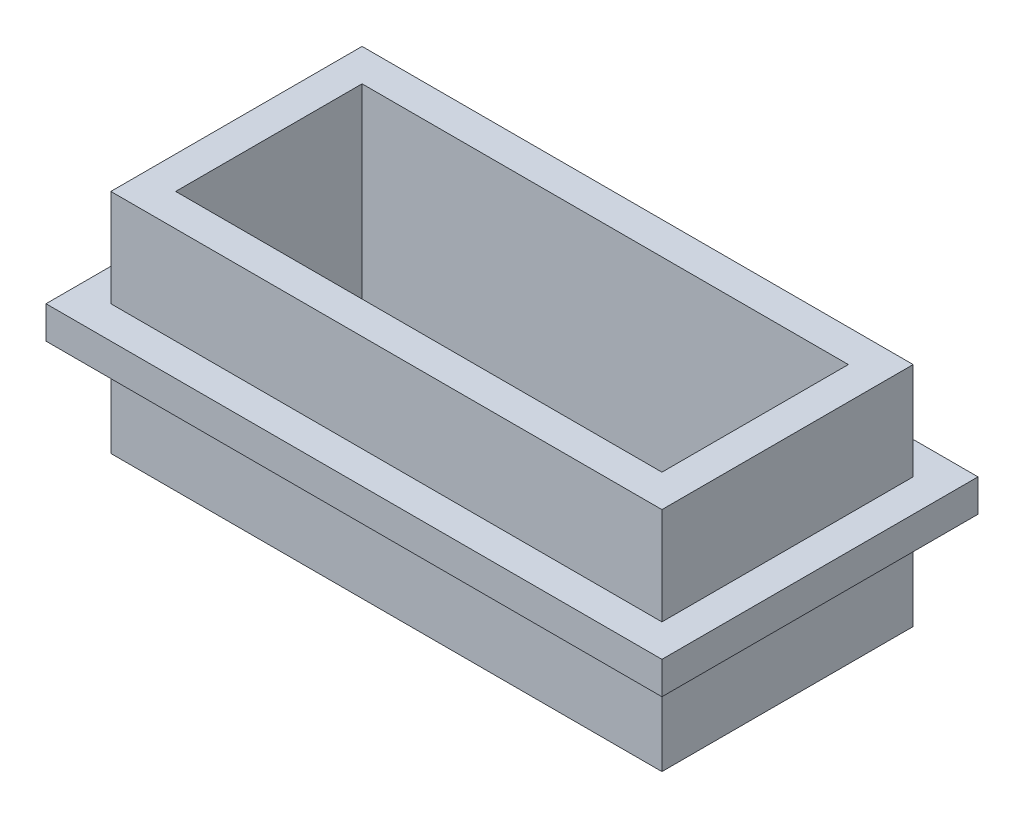
ISO-10303-21;
HEADER;
FILE_DESCRIPTION(('STEP AP214'),'2;1');
FILE_NAME('part.step','',(''),(''),'','','');
FILE_SCHEMA(('AUTOMOTIVE_DESIGN { 1 0 10303 214 1 1 1 1 }'));
ENDSEC;
DATA;
#1=APPLICATION_CONTEXT('core data for automotive mechanical design processes');
#2=APPLICATION_PROTOCOL_DEFINITION('international standard','automotive_design',2000,#1);
#3=PRODUCT_CONTEXT('',#1,'mechanical');
#4=PRODUCT('Part','Part','',(#3));
#5=PRODUCT_RELATED_PRODUCT_CATEGORY('part','',(#4));
#6=PRODUCT_DEFINITION_FORMATION('','',#4);
#7=PRODUCT_DEFINITION_CONTEXT('part definition',#1,'design');
#8=PRODUCT_DEFINITION('design','',#6,#7);
#9=PRODUCT_DEFINITION_SHAPE('','',#8);
#10=(LENGTH_UNIT() NAMED_UNIT(*) SI_UNIT(.MILLI.,.METRE.));
#11=(NAMED_UNIT(*) PLANE_ANGLE_UNIT() SI_UNIT($,.RADIAN.));
#12=(NAMED_UNIT(*) SI_UNIT($,.STERADIAN.) SOLID_ANGLE_UNIT());
#13=UNCERTAINTY_MEASURE_WITH_UNIT(LENGTH_MEASURE(1.E-05),#10,'distance_accuracy_value','');
#14=(GEOMETRIC_REPRESENTATION_CONTEXT(3) GLOBAL_UNCERTAINTY_ASSIGNED_CONTEXT((#13)) GLOBAL_UNIT_ASSIGNED_CONTEXT((#10,
#11,#12)) REPRESENTATION_CONTEXT('',''));
#15=CARTESIAN_POINT('',(0.,0.,0.));
#16=DIRECTION('',(0.,0.,1.));
#17=DIRECTION('',(1.,0.,0.));
#18=AXIS2_PLACEMENT_3D('',#15,#16,#17);
#19=CARTESIAN_POINT('',(21.59,17.78,-9.8425));
#20=DIRECTION('',(-1.,0.,0.));
#21=DIRECTION('',(0.,0.,1.));
#22=AXIS2_PLACEMENT_3D('',#19,#20,#21);
#23=PLANE('',#22);
#24=DIRECTION('',(0.,0.,1.));
#25=VECTOR('',#24,1.);
#26=CARTESIAN_POINT('',(21.59,10.16,-9.8425));
#27=LINE('',#26,#25);
#28=CARTESIAN_POINT('',(21.59,10.16,-9.8425));
#29=VERTEX_POINT('',#28);
#30=CARTESIAN_POINT('',(21.59,10.16,9.8425));
#31=VERTEX_POINT('',#30);
#32=EDGE_CURVE('E53',#29,#31,#27,.T.);
#33=ORIENTED_EDGE('',*,*,#32,.F.);
#34=DIRECTION('',(0.,-1.,0.));
#35=VECTOR('',#34,1.);
#36=CARTESIAN_POINT('',(21.59,17.78,-9.8425));
#37=LINE('',#36,#35);
#38=CARTESIAN_POINT('',(21.59,17.78,-9.8425));
#39=VERTEX_POINT('',#38);
#40=EDGE_CURVE('E11',#39,#29,#37,.T.);
#41=ORIENTED_EDGE('',*,*,#40,.F.);
#42=DIRECTION('',(0.,0.,-1.));
#43=VECTOR('',#42,1.);
#44=CARTESIAN_POINT('',(21.59,17.78,-9.8425));
#45=LINE('',#44,#43);
#46=CARTESIAN_POINT('',(21.59,17.78,9.8425));
#47=VERTEX_POINT('',#46);
#48=EDGE_CURVE('E234',#47,#39,#45,.T.);
#49=ORIENTED_EDGE('',*,*,#48,.F.);
#50=DIRECTION('',(0.,-1.,0.));
#51=VECTOR('',#50,1.);
#52=CARTESIAN_POINT('',(21.59,17.78,9.8425));
#53=LINE('',#52,#51);
#54=EDGE_CURVE('E255',#47,#31,#53,.T.);
#55=ORIENTED_EDGE('',*,*,#54,.T.);
#56=EDGE_LOOP('',(#33,#41,#49,#55));
#57=FACE_BOUND('',#56,.T.);
#58=ADVANCED_FACE('F38',(#57),#23,.F.);
#59=CARTESIAN_POINT('',(-21.59,17.78,-9.8425));
#60=DIRECTION('',(0.,0.,1.));
#61=DIRECTION('',(1.,0.,0.));
#62=AXIS2_PLACEMENT_3D('',#59,#60,#61);
#63=PLANE('',#62);
#64=DIRECTION('',(1.,0.,0.));
#65=VECTOR('',#64,1.);
#66=CARTESIAN_POINT('',(-21.59,10.16,-9.8425));
#67=LINE('',#66,#65);
#68=CARTESIAN_POINT('',(-21.59,10.16,-9.8425));
#69=VERTEX_POINT('',#68);
#70=EDGE_CURVE('E59',#69,#29,#67,.T.);
#71=ORIENTED_EDGE('',*,*,#70,.F.);
#72=DIRECTION('',(0.,-1.,0.));
#73=VECTOR('',#72,1.);
#74=CARTESIAN_POINT('',(-21.59,17.78,-9.8425));
#75=LINE('',#74,#73);
#76=CARTESIAN_POINT('',(-21.59,17.78,-9.8425));
#77=VERTEX_POINT('',#76);
#78=EDGE_CURVE('E260',#77,#69,#75,.T.);
#79=ORIENTED_EDGE('',*,*,#78,.F.);
#80=DIRECTION('',(-1.,0.,0.));
#81=VECTOR('',#80,1.);
#82=CARTESIAN_POINT('',(-21.59,17.78,-9.8425));
#83=LINE('',#82,#81);
#84=EDGE_CURVE('E237',#39,#77,#83,.T.);
#85=ORIENTED_EDGE('',*,*,#84,.F.);
#86=ORIENTED_EDGE('',*,*,#40,.T.);
#87=EDGE_LOOP('',(#71,#79,#85,#86));
#88=FACE_BOUND('',#87,.T.);
#89=ADVANCED_FACE('F289',(#88),#63,.F.);
#90=CARTESIAN_POINT('',(-21.59,17.78,-9.8425));
#91=DIRECTION('',(1.,0.,0.));
#92=DIRECTION('',(0.,0.,-1.));
#93=AXIS2_PLACEMENT_3D('',#90,#91,#92);
#94=PLANE('',#93);
#95=DIRECTION('',(0.,0.,-1.));
#96=VECTOR('',#95,1.);
#97=CARTESIAN_POINT('',(-21.59,10.16,-9.8425));
#98=LINE('',#97,#96);
#99=CARTESIAN_POINT('',(-21.59,10.16,9.8425));
#100=VERTEX_POINT('',#99);
#101=EDGE_CURVE('E199',#100,#69,#98,.T.);
#102=ORIENTED_EDGE('',*,*,#101,.F.);
#103=DIRECTION('',(0.,-1.,0.));
#104=VECTOR('',#103,1.);
#105=CARTESIAN_POINT('',(-21.59,17.78,9.8425));
#106=LINE('',#105,#104);
#107=CARTESIAN_POINT('',(-21.59,17.78,9.8425));
#108=VERTEX_POINT('',#107);
#109=EDGE_CURVE('E258',#108,#100,#106,.T.);
#110=ORIENTED_EDGE('',*,*,#109,.F.);
#111=DIRECTION('',(0.,0.,1.));
#112=VECTOR('',#111,1.);
#113=CARTESIAN_POINT('',(-21.59,17.78,-9.8425));
#114=LINE('',#113,#112);
#115=EDGE_CURVE('E240',#77,#108,#114,.T.);
#116=ORIENTED_EDGE('',*,*,#115,.F.);
#117=ORIENTED_EDGE('',*,*,#78,.T.);
#118=EDGE_LOOP('',(#102,#110,#116,#117));
#119=FACE_BOUND('',#118,.T.);
#120=ADVANCED_FACE('F296',(#119),#94,.F.);
#121=CARTESIAN_POINT('',(-21.59,17.78,9.8425));
#122=DIRECTION('',(0.,0.,-1.));
#123=DIRECTION('',(-1.,0.,0.));
#124=AXIS2_PLACEMENT_3D('',#121,#122,#123);
#125=PLANE('',#124);
#126=DIRECTION('',(-1.,0.,0.));
#127=VECTOR('',#126,1.);
#128=CARTESIAN_POINT('',(-21.59,10.16,9.8425));
#129=LINE('',#128,#127);
#130=EDGE_CURVE('E196',#31,#100,#129,.T.);
#131=ORIENTED_EDGE('',*,*,#130,.F.);
#132=ORIENTED_EDGE('',*,*,#54,.F.);
#133=DIRECTION('',(1.,0.,0.));
#134=VECTOR('',#133,1.);
#135=CARTESIAN_POINT('',(-21.59,17.78,9.8425));
#136=LINE('',#135,#134);
#137=EDGE_CURVE('E242',#108,#47,#136,.T.);
#138=ORIENTED_EDGE('',*,*,#137,.F.);
#139=ORIENTED_EDGE('',*,*,#109,.T.);
#140=EDGE_LOOP('',(#131,#132,#138,#139));
#141=FACE_BOUND('',#140,.T.);
#142=ADVANCED_FACE('F300',(#141),#125,.F.);
#143=CARTESIAN_POINT('',(0.,17.78,0.));
#144=DIRECTION('',(0.,1.,0.));
#145=DIRECTION('',(0.,0.,1.));
#146=AXIS2_PLACEMENT_3D('',#143,#144,#145);
#147=PLANE('',#146);
#148=ORIENTED_EDGE('',*,*,#48,.T.);
#149=ORIENTED_EDGE('',*,*,#84,.T.);
#150=ORIENTED_EDGE('',*,*,#115,.T.);
#151=ORIENTED_EDGE('',*,*,#137,.T.);
#152=EDGE_LOOP('',(#148,#149,#150,#151));
#153=FACE_BOUND('',#152,.T.);
#154=DIRECTION('',(-1.,0.,0.));
#155=VECTOR('',#154,1.);
#156=CARTESIAN_POINT('',(-19.05,17.78,-7.3025));
#157=LINE('',#156,#155);
#158=CARTESIAN_POINT('',(19.05,17.78,-7.3025));
#159=VERTEX_POINT('',#158);
#160=CARTESIAN_POINT('',(-19.05,17.78,-7.3025));
#161=VERTEX_POINT('',#160);
#162=EDGE_CURVE('E207',#159,#161,#157,.T.);
#163=ORIENTED_EDGE('',*,*,#162,.F.);
#164=DIRECTION('',(0.,0.,-1.));
#165=VECTOR('',#164,1.);
#166=CARTESIAN_POINT('',(19.05,17.78,-7.3025));
#167=LINE('',#166,#165);
#168=CARTESIAN_POINT('',(19.05,17.78,7.3025));
#169=VERTEX_POINT('',#168);
#170=EDGE_CURVE('E205',#169,#159,#167,.T.);
#171=ORIENTED_EDGE('',*,*,#170,.F.);
#172=DIRECTION('',(1.,0.,0.));
#173=VECTOR('',#172,1.);
#174=CARTESIAN_POINT('',(-19.05,17.78,7.3025));
#175=LINE('',#174,#173);
#176=CARTESIAN_POINT('',(-19.05,17.78,7.3025));
#177=VERTEX_POINT('',#176);
#178=EDGE_CURVE('E213',#177,#169,#175,.T.);
#179=ORIENTED_EDGE('',*,*,#178,.F.);
#180=DIRECTION('',(0.,0.,1.));
#181=VECTOR('',#180,1.);
#182=CARTESIAN_POINT('',(-19.05,17.78,-7.3025));
#183=LINE('',#182,#181);
#184=EDGE_CURVE('E210',#161,#177,#183,.T.);
#185=ORIENTED_EDGE('',*,*,#184,.F.);
#186=EDGE_LOOP('',(#163,#171,#179,#185));
#187=FACE_BOUND('',#186,.T.);
#188=ADVANCED_FACE('F290',(#153,#187),#147,.T.);
#189=CARTESIAN_POINT('',(0.,0.,0.));
#190=DIRECTION('',(0.,1.,0.));
#191=DIRECTION('',(0.,0.,1.));
#192=AXIS2_PLACEMENT_3D('',#189,#190,#191);
#193=PLANE('',#192);
#194=DIRECTION('',(0.,0.,-1.));
#195=VECTOR('',#194,1.);
#196=CARTESIAN_POINT('',(21.59,0.,-9.8425));
#197=LINE('',#196,#195);
#198=CARTESIAN_POINT('',(21.59,0.,9.8425));
#199=VERTEX_POINT('',#198);
#200=CARTESIAN_POINT('',(21.59,0.,-9.8425));
#201=VERTEX_POINT('',#200);
#202=EDGE_CURVE('E233',#199,#201,#197,.T.);
#203=ORIENTED_EDGE('',*,*,#202,.F.);
#204=DIRECTION('',(1.,0.,0.));
#205=VECTOR('',#204,1.);
#206=CARTESIAN_POINT('',(-21.59,0.,9.8425));
#207=LINE('',#206,#205);
#208=CARTESIAN_POINT('',(-21.59,0.,9.8425));
#209=VERTEX_POINT('',#208);
#210=EDGE_CURVE('E238',#209,#199,#207,.T.);
#211=ORIENTED_EDGE('',*,*,#210,.F.);
#212=DIRECTION('',(0.,0.,1.));
#213=VECTOR('',#212,1.);
#214=CARTESIAN_POINT('',(-21.59,0.,-9.8425));
#215=LINE('',#214,#213);
#216=CARTESIAN_POINT('',(-21.59,0.,-9.8425));
#217=VERTEX_POINT('',#216);
#218=EDGE_CURVE('E250',#217,#209,#215,.T.);
#219=ORIENTED_EDGE('',*,*,#218,.F.);
#220=DIRECTION('',(-1.,0.,0.));
#221=VECTOR('',#220,1.);
#222=CARTESIAN_POINT('',(-21.59,0.,-9.8425));
#223=LINE('',#222,#221);
#224=EDGE_CURVE('E247',#201,#217,#223,.T.);
#225=ORIENTED_EDGE('',*,*,#224,.F.);
#226=EDGE_LOOP('',(#203,#211,#219,#225));
#227=FACE_BOUND('',#226,.T.);
#228=DIRECTION('',(0.,0.,-1.));
#229=VECTOR('',#228,1.);
#230=CARTESIAN_POINT('',(19.05,0.,-7.3025));
#231=LINE('',#230,#229);
#232=CARTESIAN_POINT('',(19.05,0.,7.3025));
#233=VERTEX_POINT('',#232);
#234=CARTESIAN_POINT('',(19.05,0.,-7.3025));
#235=VERTEX_POINT('',#234);
#236=EDGE_CURVE('E204',#233,#235,#231,.T.);
#237=ORIENTED_EDGE('',*,*,#236,.T.);
#238=DIRECTION('',(-1.,0.,0.));
#239=VECTOR('',#238,1.);
#240=CARTESIAN_POINT('',(-19.05,0.,-7.3025));
#241=LINE('',#240,#239);
#242=CARTESIAN_POINT('',(-19.05,0.,-7.3025));
#243=VERTEX_POINT('',#242);
#244=EDGE_CURVE('E218',#235,#243,#241,.T.);
#245=ORIENTED_EDGE('',*,*,#244,.T.);
#246=DIRECTION('',(0.,0.,1.));
#247=VECTOR('',#246,1.);
#248=CARTESIAN_POINT('',(-19.05,0.,-7.3025));
#249=LINE('',#248,#247);
#250=CARTESIAN_POINT('',(-19.05,0.,7.3025));
#251=VERTEX_POINT('',#250);
#252=EDGE_CURVE('E221',#243,#251,#249,.T.);
#253=ORIENTED_EDGE('',*,*,#252,.T.);
#254=DIRECTION('',(1.,0.,0.));
#255=VECTOR('',#254,1.);
#256=CARTESIAN_POINT('',(-19.05,0.,7.3025));
#257=LINE('',#256,#255);
#258=EDGE_CURVE('E208',#251,#233,#257,.T.);
#259=ORIENTED_EDGE('',*,*,#258,.T.);
#260=EDGE_LOOP('',(#237,#245,#253,#259));
#261=FACE_BOUND('',#260,.T.);
#262=ADVANCED_FACE('F276',(#227,#261),#193,.F.);
#263=CARTESIAN_POINT('',(21.59,7.62,-9.8425));
#264=VERTEX_POINT('',#263);
#265=EDGE_CURVE('E46',#264,#201,#37,.T.);
#266=ORIENTED_EDGE('',*,*,#265,.F.);
#267=DIRECTION('',(0.,0.,1.));
#268=VECTOR('',#267,1.);
#269=CARTESIAN_POINT('',(21.59,7.62,-9.8425));
#270=LINE('',#269,#268);
#271=CARTESIAN_POINT('',(21.59,7.62,9.8425));
#272=VERTEX_POINT('',#271);
#273=EDGE_CURVE('E193',#264,#272,#270,.T.);
#274=ORIENTED_EDGE('',*,*,#273,.T.);
#275=EDGE_CURVE('E244',#272,#199,#53,.T.);
#276=ORIENTED_EDGE('',*,*,#275,.T.);
#277=ORIENTED_EDGE('',*,*,#202,.T.);
#278=EDGE_LOOP('',(#266,#274,#276,#277));
#279=FACE_BOUND('',#278,.T.);
#280=ADVANCED_FACE('F40',(#279),#23,.F.);
#281=CARTESIAN_POINT('',(-21.59,7.62,-9.8425));
#282=VERTEX_POINT('',#281);
#283=EDGE_CURVE('E259',#282,#217,#75,.T.);
#284=ORIENTED_EDGE('',*,*,#283,.F.);
#285=DIRECTION('',(1.,0.,0.));
#286=VECTOR('',#285,1.);
#287=CARTESIAN_POINT('',(-21.59,7.62,-9.8425));
#288=LINE('',#287,#286);
#289=EDGE_CURVE('E190',#282,#264,#288,.T.);
#290=ORIENTED_EDGE('',*,*,#289,.T.);
#291=ORIENTED_EDGE('',*,*,#265,.T.);
#292=ORIENTED_EDGE('',*,*,#224,.T.);
#293=EDGE_LOOP('',(#284,#290,#291,#292));
#294=FACE_BOUND('',#293,.T.);
#295=ADVANCED_FACE('F272',(#294),#63,.F.);
#296=CARTESIAN_POINT('',(-21.59,7.62,9.8425));
#297=VERTEX_POINT('',#296);
#298=EDGE_CURVE('E257',#297,#209,#106,.T.);
#299=ORIENTED_EDGE('',*,*,#298,.F.);
#300=DIRECTION('',(0.,0.,-1.));
#301=VECTOR('',#300,1.);
#302=CARTESIAN_POINT('',(-21.59,7.62,-9.8425));
#303=LINE('',#302,#301);
#304=EDGE_CURVE('E182',#297,#282,#303,.T.);
#305=ORIENTED_EDGE('',*,*,#304,.T.);
#306=ORIENTED_EDGE('',*,*,#283,.T.);
#307=ORIENTED_EDGE('',*,*,#218,.T.);
#308=EDGE_LOOP('',(#299,#305,#306,#307));
#309=FACE_BOUND('',#308,.T.);
#310=ADVANCED_FACE('F267',(#309),#94,.F.);
#311=ORIENTED_EDGE('',*,*,#275,.F.);
#312=DIRECTION('',(-1.,0.,0.));
#313=VECTOR('',#312,1.);
#314=CARTESIAN_POINT('',(-21.59,7.62,9.8425));
#315=LINE('',#314,#313);
#316=EDGE_CURVE('E179',#272,#297,#315,.T.);
#317=ORIENTED_EDGE('',*,*,#316,.T.);
#318=ORIENTED_EDGE('',*,*,#298,.T.);
#319=ORIENTED_EDGE('',*,*,#210,.T.);
#320=EDGE_LOOP('',(#311,#317,#318,#319));
#321=FACE_BOUND('',#320,.T.);
#322=ADVANCED_FACE('F280',(#321),#125,.F.);
#323=CARTESIAN_POINT('',(19.05,17.78,-7.3025));
#324=DIRECTION('',(-1.,0.,0.));
#325=DIRECTION('',(0.,0.,1.));
#326=AXIS2_PLACEMENT_3D('',#323,#324,#325);
#327=PLANE('',#326);
#328=ORIENTED_EDGE('',*,*,#236,.F.);
#329=DIRECTION('',(0.,-1.,0.));
#330=VECTOR('',#329,1.);
#331=CARTESIAN_POINT('',(19.05,17.78,7.3025));
#332=LINE('',#331,#330);
#333=EDGE_CURVE('E215',#169,#233,#332,.T.);
#334=ORIENTED_EDGE('',*,*,#333,.F.);
#335=ORIENTED_EDGE('',*,*,#170,.T.);
#336=DIRECTION('',(0.,-1.,0.));
#337=VECTOR('',#336,1.);
#338=CARTESIAN_POINT('',(19.05,17.78,-7.3025));
#339=LINE('',#338,#337);
#340=EDGE_CURVE('E231',#159,#235,#339,.T.);
#341=ORIENTED_EDGE('',*,*,#340,.T.);
#342=EDGE_LOOP('',(#328,#334,#335,#341));
#343=FACE_BOUND('',#342,.T.);
#344=ADVANCED_FACE('F305',(#343),#327,.T.);
#345=CARTESIAN_POINT('',(-19.05,17.78,-7.3025));
#346=DIRECTION('',(0.,0.,1.));
#347=DIRECTION('',(1.,0.,0.));
#348=AXIS2_PLACEMENT_3D('',#345,#346,#347);
#349=PLANE('',#348);
#350=ORIENTED_EDGE('',*,*,#244,.F.);
#351=ORIENTED_EDGE('',*,*,#340,.F.);
#352=ORIENTED_EDGE('',*,*,#162,.T.);
#353=DIRECTION('',(0.,-1.,0.));
#354=VECTOR('',#353,1.);
#355=CARTESIAN_POINT('',(-19.05,17.78,-7.3025));
#356=LINE('',#355,#354);
#357=EDGE_CURVE('E229',#161,#243,#356,.T.);
#358=ORIENTED_EDGE('',*,*,#357,.T.);
#359=EDGE_LOOP('',(#350,#351,#352,#358));
#360=FACE_BOUND('',#359,.T.);
#361=ADVANCED_FACE('F312',(#360),#349,.T.);
#362=CARTESIAN_POINT('',(-19.05,17.78,-7.3025));
#363=DIRECTION('',(1.,0.,0.));
#364=DIRECTION('',(0.,0.,-1.));
#365=AXIS2_PLACEMENT_3D('',#362,#363,#364);
#366=PLANE('',#365);
#367=ORIENTED_EDGE('',*,*,#252,.F.);
#368=ORIENTED_EDGE('',*,*,#357,.F.);
#369=ORIENTED_EDGE('',*,*,#184,.T.);
#370=DIRECTION('',(0.,-1.,0.));
#371=VECTOR('',#370,1.);
#372=CARTESIAN_POINT('',(-19.05,17.78,7.3025));
#373=LINE('',#372,#371);
#374=EDGE_CURVE('E227',#177,#251,#373,.T.);
#375=ORIENTED_EDGE('',*,*,#374,.T.);
#376=EDGE_LOOP('',(#367,#368,#369,#375));
#377=FACE_BOUND('',#376,.T.);
#378=ADVANCED_FACE('F316',(#377),#366,.T.);
#379=CARTESIAN_POINT('',(-19.05,17.78,7.3025));
#380=DIRECTION('',(0.,0.,-1.));
#381=DIRECTION('',(-1.,0.,0.));
#382=AXIS2_PLACEMENT_3D('',#379,#380,#381);
#383=PLANE('',#382);
#384=ORIENTED_EDGE('',*,*,#258,.F.);
#385=ORIENTED_EDGE('',*,*,#374,.F.);
#386=ORIENTED_EDGE('',*,*,#178,.T.);
#387=ORIENTED_EDGE('',*,*,#333,.T.);
#388=EDGE_LOOP('',(#384,#385,#386,#387));
#389=FACE_BOUND('',#388,.T.);
#390=ADVANCED_FACE('F320',(#389),#383,.T.);
#391=CARTESIAN_POINT('',(0.,10.16,0.));
#392=DIRECTION('',(0.,-1.,0.));
#393=DIRECTION('',(0.,0.,-1.));
#394=AXIS2_PLACEMENT_3D('',#391,#392,#393);
#395=PLANE('',#394);
#396=DIRECTION('',(0.,0.,-1.));
#397=VECTOR('',#396,1.);
#398=CARTESIAN_POINT('',(24.13,10.16,12.3825));
#399=LINE('',#398,#397);
#400=CARTESIAN_POINT('',(24.13,10.16,12.3825));
#401=VERTEX_POINT('',#400);
#402=CARTESIAN_POINT('',(24.13,10.16,-12.3825));
#403=VERTEX_POINT('',#402);
#404=EDGE_CURVE('E164',#401,#403,#399,.T.);
#405=ORIENTED_EDGE('',*,*,#404,.T.);
#406=DIRECTION('',(-1.,0.,0.));
#407=VECTOR('',#406,1.);
#408=CARTESIAN_POINT('',(-24.13,10.16,-12.3825));
#409=LINE('',#408,#407);
#410=CARTESIAN_POINT('',(-24.13,10.16,-12.3825));
#411=VERTEX_POINT('',#410);
#412=EDGE_CURVE('E153',#403,#411,#409,.T.);
#413=ORIENTED_EDGE('',*,*,#412,.T.);
#414=DIRECTION('',(0.,0.,1.));
#415=VECTOR('',#414,1.);
#416=CARTESIAN_POINT('',(-24.13,10.16,12.3825));
#417=LINE('',#416,#415);
#418=CARTESIAN_POINT('',(-24.13,10.16,12.3825));
#419=VERTEX_POINT('',#418);
#420=EDGE_CURVE('E163',#411,#419,#417,.T.);
#421=ORIENTED_EDGE('',*,*,#420,.T.);
#422=DIRECTION('',(1.,0.,0.));
#423=VECTOR('',#422,1.);
#424=CARTESIAN_POINT('',(-24.13,10.16,12.3825));
#425=LINE('',#424,#423);
#426=EDGE_CURVE('E170',#419,#401,#425,.T.);
#427=ORIENTED_EDGE('',*,*,#426,.T.);
#428=EDGE_LOOP('',(#405,#413,#421,#427));
#429=FACE_BOUND('',#428,.T.);
#430=ORIENTED_EDGE('',*,*,#70,.T.);
#431=ORIENTED_EDGE('',*,*,#32,.T.);
#432=ORIENTED_EDGE('',*,*,#130,.T.);
#433=ORIENTED_EDGE('',*,*,#101,.T.);
#434=EDGE_LOOP('',(#430,#431,#432,#433));
#435=FACE_BOUND('',#434,.T.);
#436=ADVANCED_FACE('F167',(#429,#435),#395,.F.);
#437=CARTESIAN_POINT('',(0.,7.62,0.));
#438=DIRECTION('',(0.,-1.,0.));
#439=DIRECTION('',(0.,0.,-1.));
#440=AXIS2_PLACEMENT_3D('',#437,#438,#439);
#441=PLANE('',#440);
#442=DIRECTION('',(0.,0.,-1.));
#443=VECTOR('',#442,1.);
#444=CARTESIAN_POINT('',(24.13,7.62,12.3825));
#445=LINE('',#444,#443);
#446=CARTESIAN_POINT('',(24.13,7.62,12.3825));
#447=VERTEX_POINT('',#446);
#448=CARTESIAN_POINT('',(24.13,7.62,-12.3825));
#449=VERTEX_POINT('',#448);
#450=EDGE_CURVE('E178',#447,#449,#445,.T.);
#451=ORIENTED_EDGE('',*,*,#450,.F.);
#452=DIRECTION('',(1.,0.,0.));
#453=VECTOR('',#452,1.);
#454=CARTESIAN_POINT('',(-24.13,7.62,12.3825));
#455=LINE('',#454,#453);
#456=CARTESIAN_POINT('',(-24.13,7.62,12.3825));
#457=VERTEX_POINT('',#456);
#458=EDGE_CURVE('E174',#457,#447,#455,.T.);
#459=ORIENTED_EDGE('',*,*,#458,.F.);
#460=DIRECTION('',(0.,0.,1.));
#461=VECTOR('',#460,1.);
#462=CARTESIAN_POINT('',(-24.13,7.62,12.3825));
#463=LINE('',#462,#461);
#464=CARTESIAN_POINT('',(-24.13,7.62,-12.3825));
#465=VERTEX_POINT('',#464);
#466=EDGE_CURVE('E477',#465,#457,#463,.T.);
#467=ORIENTED_EDGE('',*,*,#466,.F.);
#468=DIRECTION('',(-1.,0.,0.));
#469=VECTOR('',#468,1.);
#470=CARTESIAN_POINT('',(-24.13,7.62,-12.3825));
#471=LINE('',#470,#469);
#472=EDGE_CURVE('E475',#449,#465,#471,.T.);
#473=ORIENTED_EDGE('',*,*,#472,.F.);
#474=EDGE_LOOP('',(#451,#459,#467,#473));
#475=FACE_BOUND('',#474,.T.);
#476=ORIENTED_EDGE('',*,*,#273,.F.);
#477=ORIENTED_EDGE('',*,*,#289,.F.);
#478=ORIENTED_EDGE('',*,*,#304,.F.);
#479=ORIENTED_EDGE('',*,*,#316,.F.);
#480=EDGE_LOOP('',(#476,#477,#478,#479));
#481=FACE_BOUND('',#480,.T.);
#482=ADVANCED_FACE('F282',(#475,#481),#441,.T.);
#483=CARTESIAN_POINT('',(24.13,10.16,12.3825));
#484=DIRECTION('',(-1.,0.,0.));
#485=DIRECTION('',(0.,0.,1.));
#486=AXIS2_PLACEMENT_3D('',#483,#484,#485);
#487=PLANE('',#486);
#488=ORIENTED_EDGE('',*,*,#450,.T.);
#489=DIRECTION('',(0.,-1.,0.));
#490=VECTOR('',#489,1.);
#491=CARTESIAN_POINT('',(24.13,10.16,-12.3825));
#492=LINE('',#491,#490);
#493=EDGE_CURVE('E157',#403,#449,#492,.T.);
#494=ORIENTED_EDGE('',*,*,#493,.F.);
#495=ORIENTED_EDGE('',*,*,#404,.F.);
#496=DIRECTION('',(0.,-1.,0.));
#497=VECTOR('',#496,1.);
#498=CARTESIAN_POINT('',(24.13,10.16,12.3825));
#499=LINE('',#498,#497);
#500=EDGE_CURVE('E484',#401,#447,#499,.T.);
#501=ORIENTED_EDGE('',*,*,#500,.T.);
#502=EDGE_LOOP('',(#488,#494,#495,#501));
#503=FACE_BOUND('',#502,.T.);
#504=ADVANCED_FACE('F176',(#503),#487,.F.);
#505=CARTESIAN_POINT('',(-24.13,10.16,-12.3825));
#506=DIRECTION('',(0.,0.,1.));
#507=DIRECTION('',(1.,0.,0.));
#508=AXIS2_PLACEMENT_3D('',#505,#506,#507);
#509=PLANE('',#508);
#510=ORIENTED_EDGE('',*,*,#472,.T.);
#511=DIRECTION('',(0.,-1.,0.));
#512=VECTOR('',#511,1.);
#513=CARTESIAN_POINT('',(-24.13,10.16,-12.3825));
#514=LINE('',#513,#512);
#515=EDGE_CURVE('E160',#411,#465,#514,.T.);
#516=ORIENTED_EDGE('',*,*,#515,.F.);
#517=ORIENTED_EDGE('',*,*,#412,.F.);
#518=ORIENTED_EDGE('',*,*,#493,.T.);
#519=EDGE_LOOP('',(#510,#516,#517,#518));
#520=FACE_BOUND('',#519,.T.);
#521=ADVANCED_FACE('F155',(#520),#509,.F.);
#522=CARTESIAN_POINT('',(-24.13,10.16,12.3825));
#523=DIRECTION('',(1.,0.,0.));
#524=DIRECTION('',(0.,0.,-1.));
#525=AXIS2_PLACEMENT_3D('',#522,#523,#524);
#526=PLANE('',#525);
#527=ORIENTED_EDGE('',*,*,#466,.T.);
#528=DIRECTION('',(0.,-1.,0.));
#529=VECTOR('',#528,1.);
#530=CARTESIAN_POINT('',(-24.13,10.16,12.3825));
#531=LINE('',#530,#529);
#532=EDGE_CURVE('E184',#419,#457,#531,.T.);
#533=ORIENTED_EDGE('',*,*,#532,.F.);
#534=ORIENTED_EDGE('',*,*,#420,.F.);
#535=ORIENTED_EDGE('',*,*,#515,.T.);
#536=EDGE_LOOP('',(#527,#533,#534,#535));
#537=FACE_BOUND('',#536,.T.);
#538=ADVANCED_FACE('F329',(#537),#526,.F.);
#539=CARTESIAN_POINT('',(-24.13,10.16,12.3825));
#540=DIRECTION('',(0.,0.,-1.));
#541=DIRECTION('',(-1.,0.,0.));
#542=AXIS2_PLACEMENT_3D('',#539,#540,#541);
#543=PLANE('',#542);
#544=ORIENTED_EDGE('',*,*,#458,.T.);
#545=ORIENTED_EDGE('',*,*,#500,.F.);
#546=ORIENTED_EDGE('',*,*,#426,.F.);
#547=ORIENTED_EDGE('',*,*,#532,.T.);
#548=EDGE_LOOP('',(#544,#545,#546,#547));
#549=FACE_BOUND('',#548,.T.);
#550=ADVANCED_FACE('F332',(#549),#543,.F.);
#551=CLOSED_SHELL('',(#58,#89,#120,#142,#188,#262,#280,#295,#310,#322,#344,#361,#378,#390,#436,
#482,#504,#521,#538,#550));
#552=MANIFOLD_SOLID_BREP('B2',#551);
#553=ADVANCED_BREP_SHAPE_REPRESENTATION('',(#18,#552),#14);
#554=SHAPE_DEFINITION_REPRESENTATION(#9,#553);
ENDSEC;
END-ISO-10303-21;
